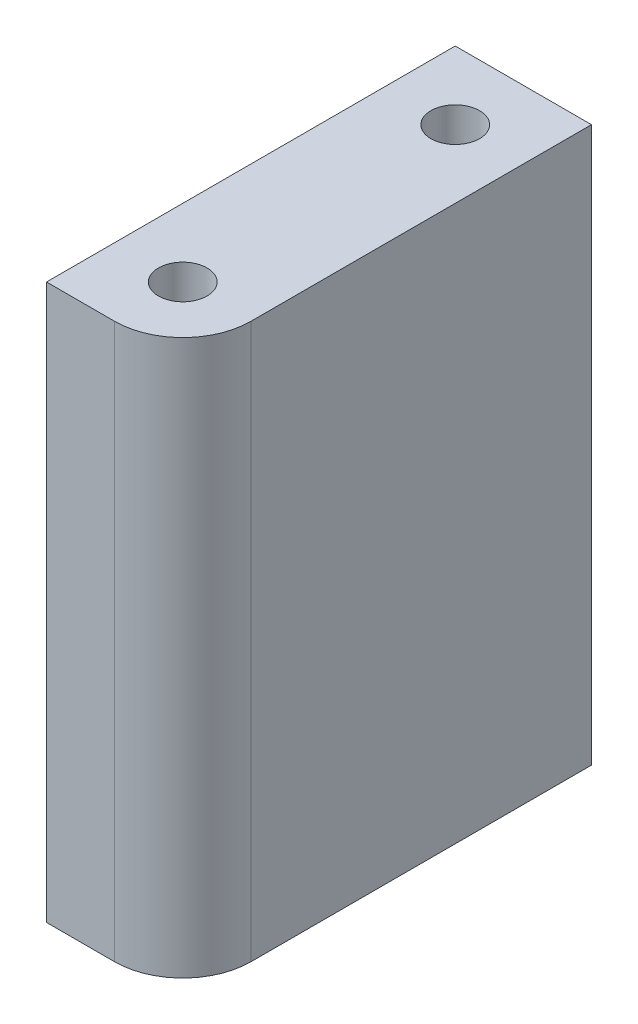
ISO-10303-21;
HEADER;
FILE_DESCRIPTION(('STEP AP214'),'2;1');
FILE_NAME('part.step','',(''),(''),'','','');
FILE_SCHEMA(('AUTOMOTIVE_DESIGN { 1 0 10303 214 1 1 1 1 }'));
ENDSEC;
DATA;
#1=APPLICATION_CONTEXT('core data for automotive mechanical design processes');
#2=APPLICATION_PROTOCOL_DEFINITION('international standard','automotive_design',2000,#1);
#3=PRODUCT_CONTEXT('',#1,'mechanical');
#4=PRODUCT('Part','Part','',(#3));
#5=PRODUCT_RELATED_PRODUCT_CATEGORY('part','',(#4));
#6=PRODUCT_DEFINITION_FORMATION('','',#4);
#7=PRODUCT_DEFINITION_CONTEXT('part definition',#1,'design');
#8=PRODUCT_DEFINITION('design','',#6,#7);
#9=PRODUCT_DEFINITION_SHAPE('','',#8);
#10=(LENGTH_UNIT() NAMED_UNIT(*) SI_UNIT(.MILLI.,.METRE.));
#11=(NAMED_UNIT(*) PLANE_ANGLE_UNIT() SI_UNIT($,.RADIAN.));
#12=(NAMED_UNIT(*) SI_UNIT($,.STERADIAN.) SOLID_ANGLE_UNIT());
#13=UNCERTAINTY_MEASURE_WITH_UNIT(LENGTH_MEASURE(1.E-05),#10,'distance_accuracy_value','');
#14=(GEOMETRIC_REPRESENTATION_CONTEXT(3) GLOBAL_UNCERTAINTY_ASSIGNED_CONTEXT((#13)) GLOBAL_UNIT_ASSIGNED_CONTEXT((#10,
#11,#12)) REPRESENTATION_CONTEXT('',''));
#15=CARTESIAN_POINT('',(0.,0.,0.));
#16=DIRECTION('',(0.,0.,1.));
#17=DIRECTION('',(1.,0.,0.));
#18=AXIS2_PLACEMENT_3D('',#15,#16,#17);
#19=CARTESIAN_POINT('',(0.,57.,14.));
#20=DIRECTION('',(0.,1.,0.));
#21=DIRECTION('',(0.,0.,1.));
#22=AXIS2_PLACEMENT_3D('',#19,#20,#21);
#23=PLANE('',#22);
#24=CARTESIAN_POINT('',(0.,57.,-14.));
#25=DIRECTION('',(0.,1.,0.));
#26=DIRECTION('',(0.,0.,1.));
#27=AXIS2_PLACEMENT_3D('',#24,#25,#26);
#28=CIRCLE('',#27,2.5);
#29=CARTESIAN_POINT('',(0.,57.,-11.5));
#30=VERTEX_POINT('',#29);
#31=EDGE_CURVE('E114',#30,#30,#28,.T.);
#32=ORIENTED_EDGE('',*,*,#31,.F.);
#33=EDGE_LOOP('',(#32));
#34=FACE_BOUND('',#33,.T.);
#35=CARTESIAN_POINT('',(0.,57.,14.));
#36=DIRECTION('',(0.,1.,0.));
#37=DIRECTION('',(0.,0.,1.));
#38=AXIS2_PLACEMENT_3D('',#35,#36,#37);
#39=CIRCLE('',#38,7.);
#40=CARTESIAN_POINT('',(0.,57.,21.));
#41=VERTEX_POINT('',#40);
#42=CARTESIAN_POINT('',(7.,57.,14.));
#43=VERTEX_POINT('',#42);
#44=EDGE_CURVE('E119',#41,#43,#39,.T.);
#45=ORIENTED_EDGE('',*,*,#44,.T.);
#46=DIRECTION('',(0.,0.,-1.));
#47=VECTOR('',#46,1.);
#48=CARTESIAN_POINT('',(7.,57.,-21.));
#49=LINE('',#48,#47);
#50=CARTESIAN_POINT('',(7.,57.,-21.));
#51=VERTEX_POINT('',#50);
#52=EDGE_CURVE('E86',#43,#51,#49,.T.);
#53=ORIENTED_EDGE('',*,*,#52,.T.);
#54=DIRECTION('',(-1.,0.,0.));
#55=VECTOR('',#54,1.);
#56=CARTESIAN_POINT('',(-7.,57.,-21.));
#57=LINE('',#56,#55);
#58=CARTESIAN_POINT('',(-7.,57.,-21.));
#59=VERTEX_POINT('',#58);
#60=EDGE_CURVE('E90',#51,#59,#57,.T.);
#61=ORIENTED_EDGE('',*,*,#60,.T.);
#62=DIRECTION('',(0.,0.,1.));
#63=VECTOR('',#62,1.);
#64=CARTESIAN_POINT('',(-7.,57.,-21.));
#65=LINE('',#64,#63);
#66=CARTESIAN_POINT('',(-7.,57.,21.));
#67=VERTEX_POINT('',#66);
#68=EDGE_CURVE('E94',#59,#67,#65,.T.);
#69=ORIENTED_EDGE('',*,*,#68,.T.);
#70=DIRECTION('',(1.,0.,0.));
#71=VECTOR('',#70,1.);
#72=CARTESIAN_POINT('',(-7.,57.,21.));
#73=LINE('',#72,#71);
#74=EDGE_CURVE('E52',#67,#41,#73,.T.);
#75=ORIENTED_EDGE('',*,*,#74,.T.);
#76=EDGE_LOOP('',(#45,#53,#61,#69,#75));
#77=FACE_BOUND('',#76,.T.);
#78=CARTESIAN_POINT('',(0.,57.,14.));
#79=DIRECTION('',(0.,1.,0.));
#80=DIRECTION('',(0.,0.,1.));
#81=AXIS2_PLACEMENT_3D('',#78,#79,#80);
#82=CIRCLE('',#81,2.5);
#83=CARTESIAN_POINT('',(0.,57.,16.5));
#84=VERTEX_POINT('',#83);
#85=EDGE_CURVE('E156',#84,#84,#82,.T.);
#86=ORIENTED_EDGE('',*,*,#85,.F.);
#87=EDGE_LOOP('',(#86));
#88=FACE_BOUND('',#87,.T.);
#89=ADVANCED_FACE('F35',(#34,#77,#88),#23,.T.);
#90=CARTESIAN_POINT('',(0.,0.,14.));
#91=DIRECTION('',(0.,1.,0.));
#92=DIRECTION('',(0.,0.,1.));
#93=AXIS2_PLACEMENT_3D('',#90,#91,#92);
#94=PLANE('',#93);
#95=CARTESIAN_POINT('',(0.,0.,14.));
#96=DIRECTION('',(0.,1.,0.));
#97=DIRECTION('',(0.,0.,1.));
#98=AXIS2_PLACEMENT_3D('',#95,#96,#97);
#99=CIRCLE('',#98,7.);
#100=CARTESIAN_POINT('',(0.,0.,21.));
#101=VERTEX_POINT('',#100);
#102=CARTESIAN_POINT('',(7.,0.,14.));
#103=VERTEX_POINT('',#102);
#104=EDGE_CURVE('E110',#101,#103,#99,.T.);
#105=ORIENTED_EDGE('',*,*,#104,.F.);
#106=DIRECTION('',(1.,0.,0.));
#107=VECTOR('',#106,1.);
#108=CARTESIAN_POINT('',(-7.,0.,21.));
#109=LINE('',#108,#107);
#110=CARTESIAN_POINT('',(-7.,0.,21.));
#111=VERTEX_POINT('',#110);
#112=EDGE_CURVE('E78',#111,#101,#109,.T.);
#113=ORIENTED_EDGE('',*,*,#112,.F.);
#114=DIRECTION('',(0.,0.,1.));
#115=VECTOR('',#114,1.);
#116=CARTESIAN_POINT('',(-7.,0.,-21.));
#117=LINE('',#116,#115);
#118=CARTESIAN_POINT('',(-7.,0.,-21.));
#119=VERTEX_POINT('',#118);
#120=EDGE_CURVE('E72',#119,#111,#117,.T.);
#121=ORIENTED_EDGE('',*,*,#120,.F.);
#122=DIRECTION('',(-1.,0.,0.));
#123=VECTOR('',#122,1.);
#124=CARTESIAN_POINT('',(-7.,0.,-21.));
#125=LINE('',#124,#123);
#126=CARTESIAN_POINT('',(7.,0.,-21.));
#127=VERTEX_POINT('',#126);
#128=EDGE_CURVE('E101',#127,#119,#125,.T.);
#129=ORIENTED_EDGE('',*,*,#128,.F.);
#130=DIRECTION('',(0.,0.,-1.));
#131=VECTOR('',#130,1.);
#132=CARTESIAN_POINT('',(7.,0.,-21.));
#133=LINE('',#132,#131);
#134=EDGE_CURVE('E113',#103,#127,#133,.T.);
#135=ORIENTED_EDGE('',*,*,#134,.F.);
#136=EDGE_LOOP('',(#105,#113,#121,#129,#135));
#137=FACE_BOUND('',#136,.T.);
#138=CARTESIAN_POINT('',(0.,0.,-14.));
#139=DIRECTION('',(0.,1.,0.));
#140=DIRECTION('',(0.,0.,1.));
#141=AXIS2_PLACEMENT_3D('',#138,#139,#140);
#142=CIRCLE('',#141,2.5);
#143=CARTESIAN_POINT('',(0.,0.,-11.5));
#144=VERTEX_POINT('',#143);
#145=EDGE_CURVE('E162',#144,#144,#142,.T.);
#146=ORIENTED_EDGE('',*,*,#145,.T.);
#147=EDGE_LOOP('',(#146));
#148=FACE_BOUND('',#147,.T.);
#149=CARTESIAN_POINT('',(0.,0.,14.));
#150=DIRECTION('',(0.,1.,0.));
#151=DIRECTION('',(0.,0.,1.));
#152=AXIS2_PLACEMENT_3D('',#149,#150,#151);
#153=CIRCLE('',#152,2.5);
#154=CARTESIAN_POINT('',(0.,0.,16.5));
#155=VERTEX_POINT('',#154);
#156=EDGE_CURVE('E159',#155,#155,#153,.T.);
#157=ORIENTED_EDGE('',*,*,#156,.T.);
#158=EDGE_LOOP('',(#157));
#159=FACE_BOUND('',#158,.T.);
#160=ADVANCED_FACE('F123',(#137,#148,#159),#94,.F.);
#161=CARTESIAN_POINT('',(0.,57.,14.));
#162=DIRECTION('',(0.,-1.,0.));
#163=DIRECTION('',(0.,0.,-1.));
#164=AXIS2_PLACEMENT_3D('',#161,#162,#163);
#165=CYLINDRICAL_SURFACE('',#164,7.);
#166=ORIENTED_EDGE('',*,*,#104,.T.);
#167=DIRECTION('',(0.,-1.,0.));
#168=VECTOR('',#167,1.);
#169=CARTESIAN_POINT('',(7.,57.,14.));
#170=LINE('',#169,#168);
#171=EDGE_CURVE('E11',#43,#103,#170,.T.);
#172=ORIENTED_EDGE('',*,*,#171,.F.);
#173=ORIENTED_EDGE('',*,*,#44,.F.);
#174=DIRECTION('',(0.,-1.,0.));
#175=VECTOR('',#174,1.);
#176=CARTESIAN_POINT('',(0.,57.,21.));
#177=LINE('',#176,#175);
#178=EDGE_CURVE('E106',#41,#101,#177,.T.);
#179=ORIENTED_EDGE('',*,*,#178,.T.);
#180=EDGE_LOOP('',(#166,#172,#173,#179));
#181=FACE_BOUND('',#180,.T.);
#182=ADVANCED_FACE('F37',(#181),#165,.T.);
#183=CARTESIAN_POINT('',(7.,57.,-21.));
#184=DIRECTION('',(-1.,0.,0.));
#185=DIRECTION('',(0.,0.,1.));
#186=AXIS2_PLACEMENT_3D('',#183,#184,#185);
#187=PLANE('',#186);
#188=ORIENTED_EDGE('',*,*,#134,.T.);
#189=DIRECTION('',(0.,-1.,0.));
#190=VECTOR('',#189,1.);
#191=CARTESIAN_POINT('',(7.,57.,-21.));
#192=LINE('',#191,#190);
#193=EDGE_CURVE('E44',#51,#127,#192,.T.);
#194=ORIENTED_EDGE('',*,*,#193,.F.);
#195=ORIENTED_EDGE('',*,*,#52,.F.);
#196=ORIENTED_EDGE('',*,*,#171,.T.);
#197=EDGE_LOOP('',(#188,#194,#195,#196));
#198=FACE_BOUND('',#197,.T.);
#199=ADVANCED_FACE('F194',(#198),#187,.F.);
#200=CARTESIAN_POINT('',(-7.,57.,-21.));
#201=DIRECTION('',(0.,0.,1.));
#202=DIRECTION('',(1.,0.,0.));
#203=AXIS2_PLACEMENT_3D('',#200,#201,#202);
#204=PLANE('',#203);
#205=ORIENTED_EDGE('',*,*,#128,.T.);
#206=DIRECTION('',(0.,-1.,0.));
#207=VECTOR('',#206,1.);
#208=CARTESIAN_POINT('',(-7.,57.,-21.));
#209=LINE('',#208,#207);
#210=EDGE_CURVE('E98',#59,#119,#209,.T.);
#211=ORIENTED_EDGE('',*,*,#210,.F.);
#212=ORIENTED_EDGE('',*,*,#60,.F.);
#213=ORIENTED_EDGE('',*,*,#193,.T.);
#214=EDGE_LOOP('',(#205,#211,#212,#213));
#215=FACE_BOUND('',#214,.T.);
#216=ADVANCED_FACE('F99',(#215),#204,.F.);
#217=CARTESIAN_POINT('',(-7.,57.,-21.));
#218=DIRECTION('',(1.,0.,0.));
#219=DIRECTION('',(0.,0.,-1.));
#220=AXIS2_PLACEMENT_3D('',#217,#218,#219);
#221=PLANE('',#220);
#222=ORIENTED_EDGE('',*,*,#120,.T.);
#223=DIRECTION('',(0.,-1.,0.));
#224=VECTOR('',#223,1.);
#225=CARTESIAN_POINT('',(-7.,57.,21.));
#226=LINE('',#225,#224);
#227=EDGE_CURVE('E102',#67,#111,#226,.T.);
#228=ORIENTED_EDGE('',*,*,#227,.F.);
#229=ORIENTED_EDGE('',*,*,#68,.F.);
#230=ORIENTED_EDGE('',*,*,#210,.T.);
#231=EDGE_LOOP('',(#222,#228,#229,#230));
#232=FACE_BOUND('',#231,.T.);
#233=ADVANCED_FACE('F104',(#232),#221,.F.);
#234=CARTESIAN_POINT('',(-7.,57.,21.));
#235=DIRECTION('',(0.,0.,-1.));
#236=DIRECTION('',(-1.,0.,0.));
#237=AXIS2_PLACEMENT_3D('',#234,#235,#236);
#238=PLANE('',#237);
#239=ORIENTED_EDGE('',*,*,#112,.T.);
#240=ORIENTED_EDGE('',*,*,#178,.F.);
#241=ORIENTED_EDGE('',*,*,#74,.F.);
#242=ORIENTED_EDGE('',*,*,#227,.T.);
#243=EDGE_LOOP('',(#239,#240,#241,#242));
#244=FACE_BOUND('',#243,.T.);
#245=ADVANCED_FACE('F128',(#244),#238,.F.);
#246=CARTESIAN_POINT('',(0.,57.,-14.));
#247=DIRECTION('',(0.,-1.,0.));
#248=DIRECTION('',(0.,0.,-1.));
#249=AXIS2_PLACEMENT_3D('',#246,#247,#248);
#250=CYLINDRICAL_SURFACE('',#249,2.5);
#251=ORIENTED_EDGE('',*,*,#31,.T.);
#252=EDGE_LOOP('',(#251));
#253=FACE_BOUND('',#252,.T.);
#254=ORIENTED_EDGE('',*,*,#145,.F.);
#255=EDGE_LOOP('',(#254));
#256=FACE_BOUND('',#255,.T.);
#257=ADVANCED_FACE('F130',(#253,#256),#250,.F.);
#258=CARTESIAN_POINT('',(0.,57.,14.));
#259=DIRECTION('',(0.,-1.,0.));
#260=DIRECTION('',(0.,0.,-1.));
#261=AXIS2_PLACEMENT_3D('',#258,#259,#260);
#262=CYLINDRICAL_SURFACE('',#261,2.5);
#263=ORIENTED_EDGE('',*,*,#85,.T.);
#264=EDGE_LOOP('',(#263));
#265=FACE_BOUND('',#264,.T.);
#266=ORIENTED_EDGE('',*,*,#156,.F.);
#267=EDGE_LOOP('',(#266));
#268=FACE_BOUND('',#267,.T.);
#269=ADVANCED_FACE('F136',(#265,#268),#262,.F.);
#270=CLOSED_SHELL('',(#89,#160,#182,#199,#216,#233,#245,#257,#269));
#271=MANIFOLD_SOLID_BREP('B2',#270);
#272=ADVANCED_BREP_SHAPE_REPRESENTATION('',(#18,#271),#14);
#273=SHAPE_DEFINITION_REPRESENTATION(#9,#272);
ENDSEC;
END-ISO-10303-21;
